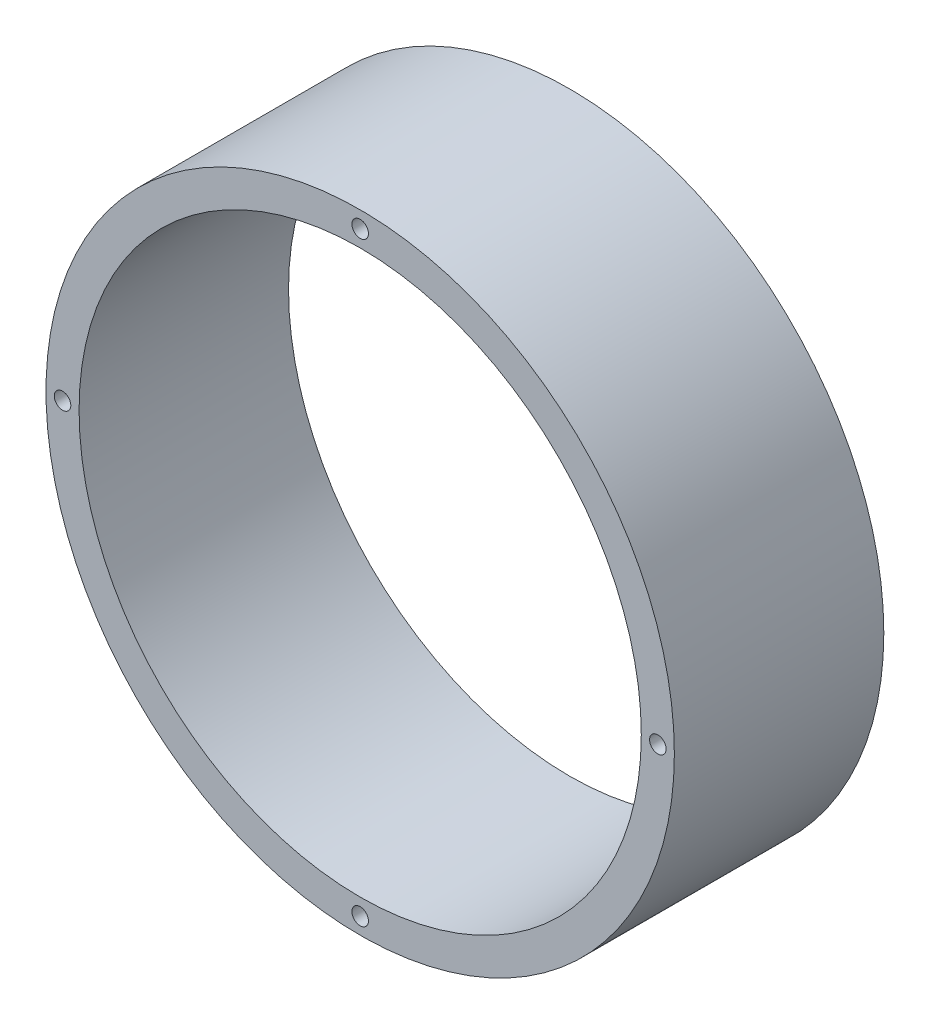
ISO-10303-21;
HEADER;
FILE_DESCRIPTION(('STEP AP214'),'2;1');
FILE_NAME('part.step','',(''),(''),'','','');
FILE_SCHEMA(('AUTOMOTIVE_DESIGN { 1 0 10303 214 1 1 1 1 }'));
ENDSEC;
DATA;
#1=APPLICATION_CONTEXT('core data for automotive mechanical design processes');
#2=APPLICATION_PROTOCOL_DEFINITION('international standard','automotive_design',2000,#1);
#3=PRODUCT_CONTEXT('',#1,'mechanical');
#4=PRODUCT('Part','Part','',(#3));
#5=PRODUCT_RELATED_PRODUCT_CATEGORY('part','',(#4));
#6=PRODUCT_DEFINITION_FORMATION('','',#4);
#7=PRODUCT_DEFINITION_CONTEXT('part definition',#1,'design');
#8=PRODUCT_DEFINITION('design','',#6,#7);
#9=PRODUCT_DEFINITION_SHAPE('','',#8);
#10=(LENGTH_UNIT() NAMED_UNIT(*) SI_UNIT(.MILLI.,.METRE.));
#11=(NAMED_UNIT(*) PLANE_ANGLE_UNIT() SI_UNIT($,.RADIAN.));
#12=(NAMED_UNIT(*) SI_UNIT($,.STERADIAN.) SOLID_ANGLE_UNIT());
#13=UNCERTAINTY_MEASURE_WITH_UNIT(LENGTH_MEASURE(1.E-05),#10,'distance_accuracy_value','');
#14=(GEOMETRIC_REPRESENTATION_CONTEXT(3) GLOBAL_UNCERTAINTY_ASSIGNED_CONTEXT((#13)) GLOBAL_UNIT_ASSIGNED_CONTEXT((#10,
#11,#12)) REPRESENTATION_CONTEXT('',''));
#15=CARTESIAN_POINT('',(0.,0.,0.));
#16=DIRECTION('',(0.,0.,1.));
#17=DIRECTION('',(1.,0.,0.));
#18=AXIS2_PLACEMENT_3D('',#15,#16,#17);
#19=CARTESIAN_POINT('',(0.,0.,38.));
#20=DIRECTION('',(0.,0.,-1.));
#21=DIRECTION('',(-1.,0.,0.));
#22=AXIS2_PLACEMENT_3D('',#19,#20,#21);
#23=CYLINDRICAL_SURFACE('',#22,57.);
#24=CARTESIAN_POINT('',(0.,0.,38.));
#25=DIRECTION('',(0.,0.,1.));
#26=DIRECTION('',(1.,0.,0.));
#27=AXIS2_PLACEMENT_3D('',#24,#25,#26);
#28=CIRCLE('',#27,57.);
#29=CARTESIAN_POINT('',(57.,0.,38.));
#30=VERTEX_POINT('',#29);
#31=EDGE_CURVE('E10',#30,#30,#28,.T.);
#32=ORIENTED_EDGE('',*,*,#31,.F.);
#33=EDGE_LOOP('',(#32));
#34=FACE_BOUND('',#33,.T.);
#35=CARTESIAN_POINT('',(0.,0.,0.));
#36=DIRECTION('',(0.,0.,1.));
#37=DIRECTION('',(1.,0.,0.));
#38=AXIS2_PLACEMENT_3D('',#35,#36,#37);
#39=CIRCLE('',#38,57.);
#40=CARTESIAN_POINT('',(57.,0.,0.));
#41=VERTEX_POINT('',#40);
#42=EDGE_CURVE('E42',#41,#41,#39,.T.);
#43=ORIENTED_EDGE('',*,*,#42,.T.);
#44=EDGE_LOOP('',(#43));
#45=FACE_BOUND('',#44,.T.);
#46=ADVANCED_FACE('F35',(#34,#45),#23,.T.);
#47=CARTESIAN_POINT('',(0.,0.,38.));
#48=DIRECTION('',(0.,0.,1.));
#49=DIRECTION('',(1.,0.,0.));
#50=AXIS2_PLACEMENT_3D('',#47,#48,#49);
#51=PLANE('',#50);
#52=CARTESIAN_POINT('',(0.,54.,38.));
#53=DIRECTION('',(0.,0.,-1.));
#54=DIRECTION('',(-1.,0.,0.));
#55=AXIS2_PLACEMENT_3D('',#52,#53,#54);
#56=CIRCLE('',#55,1.5);
#57=CARTESIAN_POINT('',(-1.5,54.,38.));
#58=VERTEX_POINT('',#57);
#59=EDGE_CURVE('E94',#58,#58,#56,.T.);
#60=ORIENTED_EDGE('',*,*,#59,.T.);
#61=EDGE_LOOP('',(#60));
#62=FACE_BOUND('',#61,.T.);
#63=CARTESIAN_POINT('',(-54.0000000000023,2.29223882478963E-12,38.));
#64=DIRECTION('',(0.,0.,-1.));
#65=DIRECTION('',(-1.,0.,0.));
#66=AXIS2_PLACEMENT_3D('',#63,#64,#65);
#67=CIRCLE('',#66,1.50000000000018);
#68=CARTESIAN_POINT('',(-55.5000000000025,2.29223882478963E-12,38.));
#69=VERTEX_POINT('',#68);
#70=EDGE_CURVE('E88',#69,#69,#67,.T.);
#71=ORIENTED_EDGE('',*,*,#70,.T.);
#72=EDGE_LOOP('',(#71));
#73=FACE_BOUND('',#72,.T.);
#74=CARTESIAN_POINT('',(-4.58447764957926E-12,-54.,38.));
#75=DIRECTION('',(0.,0.,-1.));
#76=DIRECTION('',(-1.,0.,0.));
#77=AXIS2_PLACEMENT_3D('',#74,#75,#76);
#78=CIRCLE('',#77,1.49999999999967);
#79=CARTESIAN_POINT('',(-1.50000000000426,-54.,38.));
#80=VERTEX_POINT('',#79);
#81=EDGE_CURVE('E82',#80,#80,#78,.T.);
#82=ORIENTED_EDGE('',*,*,#81,.T.);
#83=EDGE_LOOP('',(#82));
#84=FACE_BOUND('',#83,.T.);
#85=CARTESIAN_POINT('',(53.9999999999977,-2.29885191750503E-12,38.));
#86=DIRECTION('',(0.,0.,-1.));
#87=DIRECTION('',(-1.,0.,0.));
#88=AXIS2_PLACEMENT_3D('',#85,#86,#87);
#89=CIRCLE('',#88,1.50000000000025);
#90=CARTESIAN_POINT('',(52.4999999999975,-2.29885191750503E-12,38.));
#91=VERTEX_POINT('',#90);
#92=EDGE_CURVE('E76',#91,#91,#89,.T.);
#93=ORIENTED_EDGE('',*,*,#92,.T.);
#94=EDGE_LOOP('',(#93));
#95=FACE_BOUND('',#94,.T.);
#96=CARTESIAN_POINT('',(0.,0.,38.));
#97=DIRECTION('',(0.,0.,1.));
#98=DIRECTION('',(1.,0.,0.));
#99=AXIS2_PLACEMENT_3D('',#96,#97,#98);
#100=CIRCLE('',#99,51.);
#101=CARTESIAN_POINT('',(51.,0.,38.));
#102=VERTEX_POINT('',#101);
#103=EDGE_CURVE('E48',#102,#102,#100,.T.);
#104=ORIENTED_EDGE('',*,*,#103,.F.);
#105=EDGE_LOOP('',(#104));
#106=FACE_BOUND('',#105,.T.);
#107=ORIENTED_EDGE('',*,*,#31,.T.);
#108=EDGE_LOOP('',(#107));
#109=FACE_BOUND('',#108,.T.);
#110=ADVANCED_FACE('F112',(#62,#73,#84,#95,#106,#109),#51,.T.);
#111=CARTESIAN_POINT('',(0.,0.,0.));
#112=DIRECTION('',(0.,0.,1.));
#113=DIRECTION('',(1.,0.,0.));
#114=AXIS2_PLACEMENT_3D('',#111,#112,#113);
#115=PLANE('',#114);
#116=CARTESIAN_POINT('',(0.,54.,0.));
#117=DIRECTION('',(0.,0.,-1.));
#118=DIRECTION('',(-1.,0.,0.));
#119=AXIS2_PLACEMENT_3D('',#116,#117,#118);
#120=CIRCLE('',#119,1.5);
#121=CARTESIAN_POINT('',(-1.5,54.,0.));
#122=VERTEX_POINT('',#121);
#123=EDGE_CURVE('E71',#122,#122,#120,.T.);
#124=ORIENTED_EDGE('',*,*,#123,.F.);
#125=EDGE_LOOP('',(#124));
#126=FACE_BOUND('',#125,.T.);
#127=CARTESIAN_POINT('',(-54.0000000000023,2.29223882478963E-12,0.));
#128=DIRECTION('',(0.,0.,-1.));
#129=DIRECTION('',(-1.,0.,0.));
#130=AXIS2_PLACEMENT_3D('',#127,#128,#129);
#131=CIRCLE('',#130,1.50000000000018);
#132=CARTESIAN_POINT('',(-55.5000000000025,2.29223882478963E-12,0.));
#133=VERTEX_POINT('',#132);
#134=EDGE_CURVE('E65',#133,#133,#131,.T.);
#135=ORIENTED_EDGE('',*,*,#134,.F.);
#136=EDGE_LOOP('',(#135));
#137=FACE_BOUND('',#136,.T.);
#138=CARTESIAN_POINT('',(-4.58447764957926E-12,-54.,0.));
#139=DIRECTION('',(0.,0.,-1.));
#140=DIRECTION('',(-1.,0.,0.));
#141=AXIS2_PLACEMENT_3D('',#138,#139,#140);
#142=CIRCLE('',#141,1.49999999999967);
#143=CARTESIAN_POINT('',(-1.50000000000426,-54.,0.));
#144=VERTEX_POINT('',#143);
#145=EDGE_CURVE('E59',#144,#144,#142,.T.);
#146=ORIENTED_EDGE('',*,*,#145,.F.);
#147=EDGE_LOOP('',(#146));
#148=FACE_BOUND('',#147,.T.);
#149=CARTESIAN_POINT('',(53.9999999999977,-2.29885191750503E-12,0.));
#150=DIRECTION('',(0.,0.,-1.));
#151=DIRECTION('',(-1.,0.,0.));
#152=AXIS2_PLACEMENT_3D('',#149,#150,#151);
#153=CIRCLE('',#152,1.50000000000025);
#154=CARTESIAN_POINT('',(52.4999999999975,-2.29885191750503E-12,0.));
#155=VERTEX_POINT('',#154);
#156=EDGE_CURVE('E52',#155,#155,#153,.T.);
#157=ORIENTED_EDGE('',*,*,#156,.F.);
#158=EDGE_LOOP('',(#157));
#159=FACE_BOUND('',#158,.T.);
#160=CARTESIAN_POINT('',(0.,0.,0.));
#161=DIRECTION('',(0.,0.,1.));
#162=DIRECTION('',(1.,0.,0.));
#163=AXIS2_PLACEMENT_3D('',#160,#161,#162);
#164=CIRCLE('',#163,51.);
#165=CARTESIAN_POINT('',(51.,0.,0.));
#166=VERTEX_POINT('',#165);
#167=EDGE_CURVE('E38',#166,#166,#164,.T.);
#168=ORIENTED_EDGE('',*,*,#167,.T.);
#169=EDGE_LOOP('',(#168));
#170=FACE_BOUND('',#169,.T.);
#171=ORIENTED_EDGE('',*,*,#42,.F.);
#172=EDGE_LOOP('',(#171));
#173=FACE_BOUND('',#172,.T.);
#174=ADVANCED_FACE('F117',(#126,#137,#148,#159,#170,#173),#115,.F.);
#175=CARTESIAN_POINT('',(0.,0.,-1.));
#176=DIRECTION('',(0.,0.,1.));
#177=DIRECTION('',(1.,0.,0.));
#178=AXIS2_PLACEMENT_3D('',#175,#176,#177);
#179=CYLINDRICAL_SURFACE('',#178,51.);
#180=ORIENTED_EDGE('',*,*,#103,.T.);
#181=EDGE_LOOP('',(#180));
#182=FACE_BOUND('',#181,.T.);
#183=ORIENTED_EDGE('',*,*,#167,.F.);
#184=EDGE_LOOP('',(#183));
#185=FACE_BOUND('',#184,.T.);
#186=ADVANCED_FACE('F124',(#182,#185),#179,.F.);
#187=CARTESIAN_POINT('',(53.9999999999977,-2.29885191750503E-12,15.));
#188=DIRECTION('',(0.,0.,-1.));
#189=DIRECTION('',(-1.,0.,0.));
#190=AXIS2_PLACEMENT_3D('',#187,#188,#189);
#191=CYLINDRICAL_SURFACE('',#190,1.50000000000025);
#192=CARTESIAN_POINT('',(53.9999999999977,-2.29885191750503E-12,15.));
#193=DIRECTION('',(0.,0.,-1.));
#194=DIRECTION('',(-1.,0.,0.));
#195=AXIS2_PLACEMENT_3D('',#192,#193,#194);
#196=CIRCLE('',#195,1.50000000000025);
#197=CARTESIAN_POINT('',(52.4999999999975,-2.29885191750503E-12,15.));
#198=VERTEX_POINT('',#197);
#199=EDGE_CURVE('E55',#198,#198,#196,.T.);
#200=ORIENTED_EDGE('',*,*,#199,.F.);
#201=EDGE_LOOP('',(#200));
#202=FACE_BOUND('',#201,.T.);
#203=ORIENTED_EDGE('',*,*,#156,.T.);
#204=EDGE_LOOP('',(#203));
#205=FACE_BOUND('',#204,.T.);
#206=ADVANCED_FACE('F129',(#202,#205),#191,.F.);
#207=CARTESIAN_POINT('',(53.9999999999977,-2.29885191750503E-12,15.));
#208=DIRECTION('',(0.,0.,-1.));
#209=DIRECTION('',(-1.,0.,0.));
#210=AXIS2_PLACEMENT_3D('',#207,#208,#209);
#211=PLANE('',#210);
#212=ORIENTED_EDGE('',*,*,#199,.T.);
#213=EDGE_LOOP('',(#212));
#214=FACE_BOUND('',#213,.T.);
#215=ADVANCED_FACE('F137',(#214),#211,.T.);
#216=CARTESIAN_POINT('',(-4.58447764957926E-12,-54.,15.));
#217=DIRECTION('',(0.,0.,-1.));
#218=DIRECTION('',(-1.,0.,0.));
#219=AXIS2_PLACEMENT_3D('',#216,#217,#218);
#220=CYLINDRICAL_SURFACE('',#219,1.49999999999967);
#221=CARTESIAN_POINT('',(-4.58447764957926E-12,-54.,15.));
#222=DIRECTION('',(0.,0.,-1.));
#223=DIRECTION('',(-1.,0.,0.));
#224=AXIS2_PLACEMENT_3D('',#221,#222,#223);
#225=CIRCLE('',#224,1.49999999999967);
#226=CARTESIAN_POINT('',(-1.50000000000426,-54.,15.));
#227=VERTEX_POINT('',#226);
#228=EDGE_CURVE('E62',#227,#227,#225,.T.);
#229=ORIENTED_EDGE('',*,*,#228,.F.);
#230=EDGE_LOOP('',(#229));
#231=FACE_BOUND('',#230,.T.);
#232=ORIENTED_EDGE('',*,*,#145,.T.);
#233=EDGE_LOOP('',(#232));
#234=FACE_BOUND('',#233,.T.);
#235=ADVANCED_FACE('F141',(#231,#234),#220,.F.);
#236=CARTESIAN_POINT('',(-4.58447764957926E-12,-54.,15.));
#237=DIRECTION('',(0.,0.,-1.));
#238=DIRECTION('',(-1.,0.,0.));
#239=AXIS2_PLACEMENT_3D('',#236,#237,#238);
#240=PLANE('',#239);
#241=ORIENTED_EDGE('',*,*,#228,.T.);
#242=EDGE_LOOP('',(#241));
#243=FACE_BOUND('',#242,.T.);
#244=ADVANCED_FACE('F145',(#243),#240,.T.);
#245=CARTESIAN_POINT('',(-54.0000000000023,2.29223882478963E-12,15.));
#246=DIRECTION('',(0.,0.,-1.));
#247=DIRECTION('',(-1.,0.,0.));
#248=AXIS2_PLACEMENT_3D('',#245,#246,#247);
#249=CYLINDRICAL_SURFACE('',#248,1.50000000000018);
#250=CARTESIAN_POINT('',(-54.0000000000023,2.29223882478963E-12,15.));
#251=DIRECTION('',(0.,0.,-1.));
#252=DIRECTION('',(-1.,0.,0.));
#253=AXIS2_PLACEMENT_3D('',#250,#251,#252);
#254=CIRCLE('',#253,1.50000000000018);
#255=CARTESIAN_POINT('',(-55.5000000000025,2.29223882478963E-12,15.));
#256=VERTEX_POINT('',#255);
#257=EDGE_CURVE('E68',#256,#256,#254,.T.);
#258=ORIENTED_EDGE('',*,*,#257,.F.);
#259=EDGE_LOOP('',(#258));
#260=FACE_BOUND('',#259,.T.);
#261=ORIENTED_EDGE('',*,*,#134,.T.);
#262=EDGE_LOOP('',(#261));
#263=FACE_BOUND('',#262,.T.);
#264=ADVANCED_FACE('F149',(#260,#263),#249,.F.);
#265=CARTESIAN_POINT('',(-54.0000000000023,2.29223882478963E-12,15.));
#266=DIRECTION('',(0.,0.,-1.));
#267=DIRECTION('',(-1.,0.,0.));
#268=AXIS2_PLACEMENT_3D('',#265,#266,#267);
#269=PLANE('',#268);
#270=ORIENTED_EDGE('',*,*,#257,.T.);
#271=EDGE_LOOP('',(#270));
#272=FACE_BOUND('',#271,.T.);
#273=ADVANCED_FACE('F153',(#272),#269,.T.);
#274=CARTESIAN_POINT('',(0.,54.,15.));
#275=DIRECTION('',(0.,0.,-1.));
#276=DIRECTION('',(-1.,0.,0.));
#277=AXIS2_PLACEMENT_3D('',#274,#275,#276);
#278=CYLINDRICAL_SURFACE('',#277,1.5);
#279=CARTESIAN_POINT('',(0.,54.,15.));
#280=DIRECTION('',(0.,0.,-1.));
#281=DIRECTION('',(-1.,0.,0.));
#282=AXIS2_PLACEMENT_3D('',#279,#280,#281);
#283=CIRCLE('',#282,1.5);
#284=CARTESIAN_POINT('',(-1.5,54.,15.));
#285=VERTEX_POINT('',#284);
#286=EDGE_CURVE('E51',#285,#285,#283,.T.);
#287=ORIENTED_EDGE('',*,*,#286,.F.);
#288=EDGE_LOOP('',(#287));
#289=FACE_BOUND('',#288,.T.);
#290=ORIENTED_EDGE('',*,*,#123,.T.);
#291=EDGE_LOOP('',(#290));
#292=FACE_BOUND('',#291,.T.);
#293=ADVANCED_FACE('F157',(#289,#292),#278,.F.);
#294=CARTESIAN_POINT('',(0.,54.,15.));
#295=DIRECTION('',(0.,0.,-1.));
#296=DIRECTION('',(-1.,0.,0.));
#297=AXIS2_PLACEMENT_3D('',#294,#295,#296);
#298=PLANE('',#297);
#299=ORIENTED_EDGE('',*,*,#286,.T.);
#300=EDGE_LOOP('',(#299));
#301=FACE_BOUND('',#300,.T.);
#302=ADVANCED_FACE('F161',(#301),#298,.T.);
#303=CARTESIAN_POINT('',(53.9999999999977,-2.29885191750503E-12,23.));
#304=DIRECTION('',(0.,0.,1.));
#305=DIRECTION('',(1.,0.,0.));
#306=AXIS2_PLACEMENT_3D('',#303,#304,#305);
#307=CYLINDRICAL_SURFACE('',#306,1.50000000000025);
#308=CARTESIAN_POINT('',(53.9999999999977,-2.29885191750503E-12,23.));
#309=DIRECTION('',(0.,0.,-1.));
#310=DIRECTION('',(-1.,0.,0.));
#311=AXIS2_PLACEMENT_3D('',#308,#309,#310);
#312=CIRCLE('',#311,1.50000000000025);
#313=CARTESIAN_POINT('',(52.4999999999975,-2.29885191750503E-12,23.));
#314=VERTEX_POINT('',#313);
#315=EDGE_CURVE('E79',#314,#314,#312,.T.);
#316=ORIENTED_EDGE('',*,*,#315,.T.);
#317=EDGE_LOOP('',(#316));
#318=FACE_BOUND('',#317,.T.);
#319=ORIENTED_EDGE('',*,*,#92,.F.);
#320=EDGE_LOOP('',(#319));
#321=FACE_BOUND('',#320,.T.);
#322=ADVANCED_FACE('F165',(#318,#321),#307,.F.);
#323=CARTESIAN_POINT('',(53.9999999999977,-2.29885191750503E-12,23.));
#324=DIRECTION('',(0.,0.,1.));
#325=DIRECTION('',(-1.,0.,0.));
#326=AXIS2_PLACEMENT_3D('',#323,#324,#325);
#327=PLANE('',#326);
#328=ORIENTED_EDGE('',*,*,#315,.F.);
#329=EDGE_LOOP('',(#328));
#330=FACE_BOUND('',#329,.T.);
#331=ADVANCED_FACE('F169',(#330),#327,.T.);
#332=CARTESIAN_POINT('',(-4.58447764957926E-12,-54.,23.));
#333=DIRECTION('',(0.,0.,1.));
#334=DIRECTION('',(1.,0.,0.));
#335=AXIS2_PLACEMENT_3D('',#332,#333,#334);
#336=CYLINDRICAL_SURFACE('',#335,1.49999999999967);
#337=CARTESIAN_POINT('',(-4.58447764957926E-12,-54.,23.));
#338=DIRECTION('',(0.,0.,-1.));
#339=DIRECTION('',(-1.,0.,0.));
#340=AXIS2_PLACEMENT_3D('',#337,#338,#339);
#341=CIRCLE('',#340,1.49999999999967);
#342=CARTESIAN_POINT('',(-1.50000000000426,-54.,23.));
#343=VERTEX_POINT('',#342);
#344=EDGE_CURVE('E85',#343,#343,#341,.T.);
#345=ORIENTED_EDGE('',*,*,#344,.T.);
#346=EDGE_LOOP('',(#345));
#347=FACE_BOUND('',#346,.T.);
#348=ORIENTED_EDGE('',*,*,#81,.F.);
#349=EDGE_LOOP('',(#348));
#350=FACE_BOUND('',#349,.T.);
#351=ADVANCED_FACE('F173',(#347,#350),#336,.F.);
#352=CARTESIAN_POINT('',(-4.58447764957926E-12,-54.,23.));
#353=DIRECTION('',(0.,0.,1.));
#354=DIRECTION('',(-1.,0.,0.));
#355=AXIS2_PLACEMENT_3D('',#352,#353,#354);
#356=PLANE('',#355);
#357=ORIENTED_EDGE('',*,*,#344,.F.);
#358=EDGE_LOOP('',(#357));
#359=FACE_BOUND('',#358,.T.);
#360=ADVANCED_FACE('F177',(#359),#356,.T.);
#361=CARTESIAN_POINT('',(-54.0000000000023,2.29223882478963E-12,23.));
#362=DIRECTION('',(0.,0.,1.));
#363=DIRECTION('',(1.,0.,0.));
#364=AXIS2_PLACEMENT_3D('',#361,#362,#363);
#365=CYLINDRICAL_SURFACE('',#364,1.50000000000018);
#366=CARTESIAN_POINT('',(-54.0000000000023,2.29223882478963E-12,23.));
#367=DIRECTION('',(0.,0.,-1.));
#368=DIRECTION('',(-1.,0.,0.));
#369=AXIS2_PLACEMENT_3D('',#366,#367,#368);
#370=CIRCLE('',#369,1.50000000000018);
#371=CARTESIAN_POINT('',(-55.5000000000025,2.29223882478963E-12,23.));
#372=VERTEX_POINT('',#371);
#373=EDGE_CURVE('E91',#372,#372,#370,.T.);
#374=ORIENTED_EDGE('',*,*,#373,.T.);
#375=EDGE_LOOP('',(#374));
#376=FACE_BOUND('',#375,.T.);
#377=ORIENTED_EDGE('',*,*,#70,.F.);
#378=EDGE_LOOP('',(#377));
#379=FACE_BOUND('',#378,.T.);
#380=ADVANCED_FACE('F181',(#376,#379),#365,.F.);
#381=CARTESIAN_POINT('',(-54.0000000000023,2.29223882478963E-12,23.));
#382=DIRECTION('',(0.,0.,1.));
#383=DIRECTION('',(-1.,0.,0.));
#384=AXIS2_PLACEMENT_3D('',#381,#382,#383);
#385=PLANE('',#384);
#386=ORIENTED_EDGE('',*,*,#373,.F.);
#387=EDGE_LOOP('',(#386));
#388=FACE_BOUND('',#387,.T.);
#389=ADVANCED_FACE('F109',(#388),#385,.T.);
#390=CARTESIAN_POINT('',(0.,54.,23.));
#391=DIRECTION('',(0.,0.,1.));
#392=DIRECTION('',(1.,0.,0.));
#393=AXIS2_PLACEMENT_3D('',#390,#391,#392);
#394=CYLINDRICAL_SURFACE('',#393,1.5);
#395=CARTESIAN_POINT('',(0.,54.,23.));
#396=DIRECTION('',(0.,0.,-1.));
#397=DIRECTION('',(-1.,0.,0.));
#398=AXIS2_PLACEMENT_3D('',#395,#396,#397);
#399=CIRCLE('',#398,1.5);
#400=CARTESIAN_POINT('',(-1.5,54.,23.));
#401=VERTEX_POINT('',#400);
#402=EDGE_CURVE('E56',#401,#401,#399,.T.);
#403=ORIENTED_EDGE('',*,*,#402,.T.);
#404=EDGE_LOOP('',(#403));
#405=FACE_BOUND('',#404,.T.);
#406=ORIENTED_EDGE('',*,*,#59,.F.);
#407=EDGE_LOOP('',(#406));
#408=FACE_BOUND('',#407,.T.);
#409=ADVANCED_FACE('F100',(#405,#408),#394,.F.);
#410=CARTESIAN_POINT('',(0.,54.,23.));
#411=DIRECTION('',(0.,0.,1.));
#412=DIRECTION('',(-1.,0.,0.));
#413=AXIS2_PLACEMENT_3D('',#410,#411,#412);
#414=PLANE('',#413);
#415=ORIENTED_EDGE('',*,*,#402,.F.);
#416=EDGE_LOOP('',(#415));
#417=FACE_BOUND('',#416,.T.);
#418=ADVANCED_FACE('F103',(#417),#414,.T.);
#419=CLOSED_SHELL('',(#46,#110,#174,#186,#206,#215,#235,#244,#264,#273,#293,#302,#322,#331,#351,
#360,#380,#389,#409,#418));
#420=MANIFOLD_SOLID_BREP('B2',#419);
#421=ADVANCED_BREP_SHAPE_REPRESENTATION('',(#18,#420),#14);
#422=SHAPE_DEFINITION_REPRESENTATION(#9,#421);
ENDSEC;
END-ISO-10303-21;
